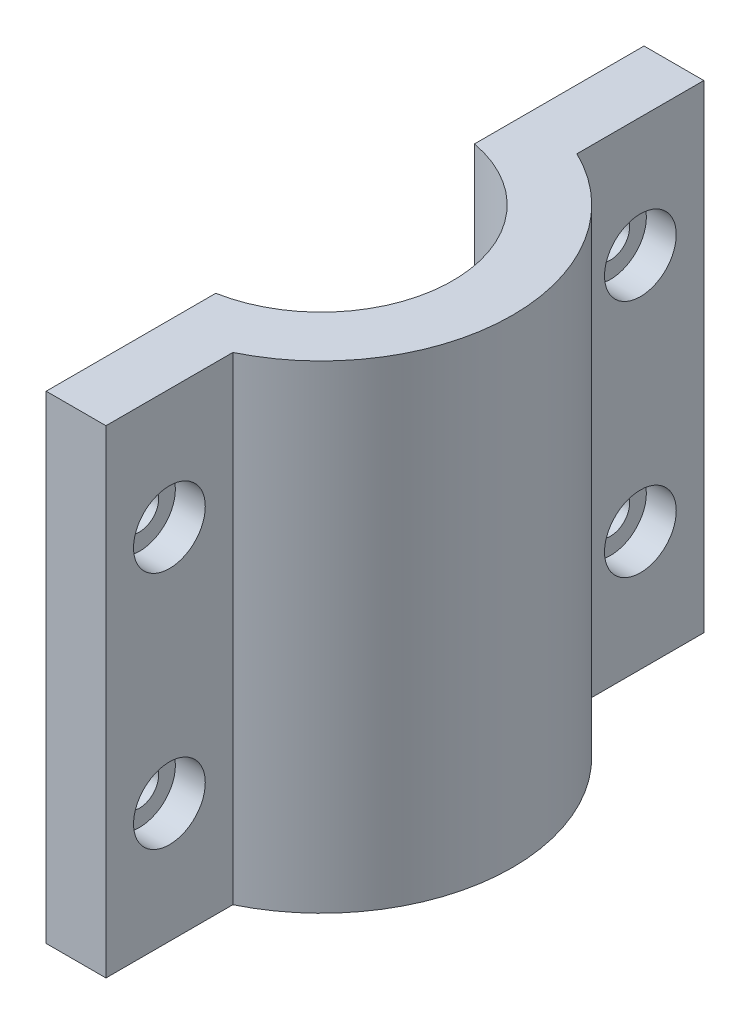
ISO-10303-21;
HEADER;
FILE_DESCRIPTION(('STEP AP214'),'2;1');
FILE_NAME('part.step','',(''),(''),'','','');
FILE_SCHEMA(('AUTOMOTIVE_DESIGN { 1 0 10303 214 1 1 1 1 }'));
ENDSEC;
DATA;
#1=APPLICATION_CONTEXT('core data for automotive mechanical design processes');
#2=APPLICATION_PROTOCOL_DEFINITION('international standard','automotive_design',2000,#1);
#3=PRODUCT_CONTEXT('',#1,'mechanical');
#4=PRODUCT('Part','Part','',(#3));
#5=PRODUCT_RELATED_PRODUCT_CATEGORY('part','',(#4));
#6=PRODUCT_DEFINITION_FORMATION('','',#4);
#7=PRODUCT_DEFINITION_CONTEXT('part definition',#1,'design');
#8=PRODUCT_DEFINITION('design','',#6,#7);
#9=PRODUCT_DEFINITION_SHAPE('','',#8);
#10=(LENGTH_UNIT() NAMED_UNIT(*) SI_UNIT(.MILLI.,.METRE.));
#11=(NAMED_UNIT(*) PLANE_ANGLE_UNIT() SI_UNIT($,.RADIAN.));
#12=(NAMED_UNIT(*) SI_UNIT($,.STERADIAN.) SOLID_ANGLE_UNIT());
#13=UNCERTAINTY_MEASURE_WITH_UNIT(LENGTH_MEASURE(1.E-05),#10,'distance_accuracy_value','');
#14=(GEOMETRIC_REPRESENTATION_CONTEXT(3) GLOBAL_UNCERTAINTY_ASSIGNED_CONTEXT((#13)) GLOBAL_UNIT_ASSIGNED_CONTEXT((#10,
#11,#12)) REPRESENTATION_CONTEXT('',''));
#15=CARTESIAN_POINT('',(0.,0.,0.));
#16=DIRECTION('',(0.,0.,1.));
#17=DIRECTION('',(1.,0.,0.));
#18=AXIS2_PLACEMENT_3D('',#15,#16,#17);
#19=CARTESIAN_POINT('',(0.,12.7,25.0110590519107));
#20=DIRECTION('',(1.,0.,0.));
#21=DIRECTION('',(0.,0.,-1.));
#22=AXIS2_PLACEMENT_3D('',#19,#20,#21);
#23=CYLINDRICAL_SURFACE('',#22,2.032);
#24=CARTESIAN_POINT('',(0.,12.7,25.0110590519107));
#25=DIRECTION('',(1.,0.,0.));
#26=DIRECTION('',(0.,0.,-1.));
#27=AXIS2_PLACEMENT_3D('',#24,#25,#26);
#28=CIRCLE('',#27,2.032);
#29=CARTESIAN_POINT('',(0.,12.7,22.9790590519107));
#30=VERTEX_POINT('',#29);
#31=EDGE_CURVE('E197',#30,#30,#28,.T.);
#32=ORIENTED_EDGE('',*,*,#31,.F.);
#33=EDGE_LOOP('',(#32));
#34=FACE_BOUND('',#33,.T.);
#35=CARTESIAN_POINT('',(3.175,12.7,25.0110590519107));
#36=DIRECTION('',(1.,0.,0.));
#37=DIRECTION('',(0.,0.,-1.));
#38=AXIS2_PLACEMENT_3D('',#35,#36,#37);
#39=CIRCLE('',#38,2.032);
#40=CARTESIAN_POINT('',(3.175,12.7,22.9790590519107));
#41=VERTEX_POINT('',#40);
#42=EDGE_CURVE('E45',#41,#41,#39,.F.);
#43=ORIENTED_EDGE('',*,*,#42,.F.);
#44=EDGE_LOOP('',(#43));
#45=FACE_BOUND('',#44,.T.);
#46=ADVANCED_FACE('F41',(#34,#45),#23,.F.);
#47=CARTESIAN_POINT('',(0.,38.1,25.0110590519107));
#48=DIRECTION('',(1.,0.,0.));
#49=DIRECTION('',(0.,0.,-1.));
#50=AXIS2_PLACEMENT_3D('',#47,#48,#49);
#51=CYLINDRICAL_SURFACE('',#50,2.032);
#52=CARTESIAN_POINT('',(0.,38.1,25.0110590519107));
#53=DIRECTION('',(1.,0.,0.));
#54=DIRECTION('',(0.,0.,1.));
#55=AXIS2_PLACEMENT_3D('',#52,#53,#54);
#56=CIRCLE('',#55,2.032);
#57=CARTESIAN_POINT('',(0.,38.1,27.0430590519107));
#58=VERTEX_POINT('',#57);
#59=EDGE_CURVE('E192',#58,#58,#56,.T.);
#60=ORIENTED_EDGE('',*,*,#59,.F.);
#61=EDGE_LOOP('',(#60));
#62=FACE_BOUND('',#61,.T.);
#63=CARTESIAN_POINT('',(3.175,38.1,25.0110590519107));
#64=DIRECTION('',(1.,0.,0.));
#65=DIRECTION('',(0.,0.,-1.));
#66=AXIS2_PLACEMENT_3D('',#63,#64,#65);
#67=CIRCLE('',#66,2.032);
#68=CARTESIAN_POINT('',(3.175,38.1,22.9790590519107));
#69=VERTEX_POINT('',#68);
#70=EDGE_CURVE('E185',#69,#69,#67,.F.);
#71=ORIENTED_EDGE('',*,*,#70,.F.);
#72=EDGE_LOOP('',(#71));
#73=FACE_BOUND('',#72,.T.);
#74=ADVANCED_FACE('F249',(#62,#73),#51,.F.);
#75=CARTESIAN_POINT('',(0.,38.1,-25.0110590519107));
#76=DIRECTION('',(1.,0.,0.));
#77=DIRECTION('',(0.,0.,-1.));
#78=AXIS2_PLACEMENT_3D('',#75,#76,#77);
#79=CYLINDRICAL_SURFACE('',#78,2.032);
#80=CARTESIAN_POINT('',(0.,38.1,-25.0110590519107));
#81=DIRECTION('',(1.,0.,0.));
#82=DIRECTION('',(0.,0.,-1.));
#83=AXIS2_PLACEMENT_3D('',#80,#81,#82);
#84=CIRCLE('',#83,2.032);
#85=CARTESIAN_POINT('',(0.,38.1,-27.0430590519107));
#86=VERTEX_POINT('',#85);
#87=EDGE_CURVE('E157',#86,#86,#84,.T.);
#88=ORIENTED_EDGE('',*,*,#87,.F.);
#89=EDGE_LOOP('',(#88));
#90=FACE_BOUND('',#89,.T.);
#91=CARTESIAN_POINT('',(3.175,38.1,-25.0110590519107));
#92=DIRECTION('',(1.,0.,0.));
#93=DIRECTION('',(0.,0.,-1.));
#94=AXIS2_PLACEMENT_3D('',#91,#92,#93);
#95=CIRCLE('',#94,2.032);
#96=CARTESIAN_POINT('',(3.175,38.1,-27.0430590519107));
#97=VERTEX_POINT('',#96);
#98=EDGE_CURVE('E181',#97,#97,#95,.F.);
#99=ORIENTED_EDGE('',*,*,#98,.F.);
#100=EDGE_LOOP('',(#99));
#101=FACE_BOUND('',#100,.T.);
#102=ADVANCED_FACE('F255',(#90,#101),#79,.F.);
#103=CARTESIAN_POINT('',(0.,12.7,-25.0110590519107));
#104=DIRECTION('',(1.,0.,0.));
#105=DIRECTION('',(0.,0.,-1.));
#106=AXIS2_PLACEMENT_3D('',#103,#104,#105);
#107=CYLINDRICAL_SURFACE('',#106,2.032);
#108=CARTESIAN_POINT('',(0.,12.7,-25.0110590519107));
#109=DIRECTION('',(1.,0.,0.));
#110=DIRECTION('',(0.,0.,1.));
#111=AXIS2_PLACEMENT_3D('',#108,#109,#110);
#112=CIRCLE('',#111,2.032);
#113=CARTESIAN_POINT('',(0.,12.7,-22.9790590519107));
#114=VERTEX_POINT('',#113);
#115=EDGE_CURVE('E203',#114,#114,#112,.T.);
#116=ORIENTED_EDGE('',*,*,#115,.F.);
#117=EDGE_LOOP('',(#116));
#118=FACE_BOUND('',#117,.T.);
#119=CARTESIAN_POINT('',(3.175,12.7,-25.0110590519107));
#120=DIRECTION('',(1.,0.,0.));
#121=DIRECTION('',(0.,0.,-1.));
#122=AXIS2_PLACEMENT_3D('',#119,#120,#121);
#123=CIRCLE('',#122,2.032);
#124=CARTESIAN_POINT('',(3.175,12.7,-27.0430590519107));
#125=VERTEX_POINT('',#124);
#126=EDGE_CURVE('E177',#125,#125,#123,.F.);
#127=ORIENTED_EDGE('',*,*,#126,.F.);
#128=EDGE_LOOP('',(#127));
#129=FACE_BOUND('',#128,.T.);
#130=ADVANCED_FACE('F261',(#118,#129),#107,.F.);
#131=CARTESIAN_POINT('',(-2.54,116.742235327596,0.));
#132=DIRECTION('',(0.,-1.,0.));
#133=DIRECTION('',(0.,0.,-1.));
#134=AXIS2_PLACEMENT_3D('',#131,#132,#133);
#135=CYLINDRICAL_SURFACE('',#134,20.32);
#136=DIRECTION('',(0.,-1.,0.));
#137=VECTOR('',#136,1.);
#138=CARTESIAN_POINT('',(6.35,116.742235327596,-18.2721181038215));
#139=LINE('',#138,#137);
#140=CARTESIAN_POINT('',(6.35,50.8,-18.2721181038215));
#141=VERTEX_POINT('',#140);
#142=CARTESIAN_POINT('',(6.35,0.,-18.2721181038215));
#143=VERTEX_POINT('',#142);
#144=EDGE_CURVE('E98',#141,#143,#139,.T.);
#145=ORIENTED_EDGE('',*,*,#144,.F.);
#146=CARTESIAN_POINT('',(-2.54,50.8,0.));
#147=DIRECTION('',(0.,1.,0.));
#148=DIRECTION('',(0.,0.,1.));
#149=AXIS2_PLACEMENT_3D('',#146,#147,#148);
#150=CIRCLE('',#149,20.32);
#151=CARTESIAN_POINT('',(6.35,50.8,18.2721181038215));
#152=VERTEX_POINT('',#151);
#153=EDGE_CURVE('E155',#141,#152,#150,.F.);
#154=ORIENTED_EDGE('',*,*,#153,.T.);
#155=DIRECTION('',(0.,-1.,0.));
#156=VECTOR('',#155,1.);
#157=CARTESIAN_POINT('',(6.35,116.742235327596,18.2721181038215));
#158=LINE('',#157,#156);
#159=CARTESIAN_POINT('',(6.35,0.,18.2721181038215));
#160=VERTEX_POINT('',#159);
#161=EDGE_CURVE('E59',#152,#160,#158,.T.);
#162=ORIENTED_EDGE('',*,*,#161,.T.);
#163=CARTESIAN_POINT('',(-2.54,0.,0.));
#164=DIRECTION('',(0.,1.,0.));
#165=DIRECTION('',(0.,0.,1.));
#166=AXIS2_PLACEMENT_3D('',#163,#164,#165);
#167=CIRCLE('',#166,20.32);
#168=EDGE_CURVE('E212',#143,#160,#167,.F.);
#169=ORIENTED_EDGE('',*,*,#168,.F.);
#170=EDGE_LOOP('',(#145,#154,#162,#169));
#171=FACE_BOUND('',#170,.T.);
#172=ADVANCED_FACE('F235',(#171),#135,.T.);
#173=CARTESIAN_POINT('',(6.35000000000002,116.742235327596,0.));
#174=DIRECTION('',(-1.,0.,0.));
#175=DIRECTION('',(0.,0.,1.));
#176=AXIS2_PLACEMENT_3D('',#173,#174,#175);
#177=PLANE('',#176);
#178=CARTESIAN_POINT('',(6.35,12.7,-25.0110590519107));
#179=DIRECTION('',(1.,0.,0.));
#180=DIRECTION('',(0.,0.,1.));
#181=AXIS2_PLACEMENT_3D('',#178,#179,#180);
#182=CIRCLE('',#181,3.81);
#183=CARTESIAN_POINT('',(6.35,12.7,-21.2010590519107));
#184=VERTEX_POINT('',#183);
#185=EDGE_CURVE('E325',#184,#184,#182,.T.);
#186=ORIENTED_EDGE('',*,*,#185,.F.);
#187=EDGE_LOOP('',(#186));
#188=FACE_BOUND('',#187,.T.);
#189=CARTESIAN_POINT('',(6.35,38.1,-25.0110590519107));
#190=DIRECTION('',(1.,0.,0.));
#191=DIRECTION('',(0.,0.,-1.));
#192=AXIS2_PLACEMENT_3D('',#189,#190,#191);
#193=CIRCLE('',#192,3.81);
#194=CARTESIAN_POINT('',(6.35,38.1,-28.8210590519107));
#195=VERTEX_POINT('',#194);
#196=EDGE_CURVE('E332',#195,#195,#193,.T.);
#197=ORIENTED_EDGE('',*,*,#196,.F.);
#198=EDGE_LOOP('',(#197));
#199=FACE_BOUND('',#198,.T.);
#200=DIRECTION('',(0.,0.,-1.));
#201=VECTOR('',#200,1.);
#202=CARTESIAN_POINT('',(6.35000000000002,50.8,0.));
#203=LINE('',#202,#201);
#204=CARTESIAN_POINT('',(6.35,50.8,-31.75));
#205=VERTEX_POINT('',#204);
#206=EDGE_CURVE('E105',#141,#205,#203,.T.);
#207=ORIENTED_EDGE('',*,*,#206,.F.);
#208=ORIENTED_EDGE('',*,*,#144,.T.);
#209=DIRECTION('',(0.,0.,-1.));
#210=VECTOR('',#209,1.);
#211=CARTESIAN_POINT('',(6.35000000000002,0.,0.));
#212=LINE('',#211,#210);
#213=CARTESIAN_POINT('',(6.35,0.,-31.75));
#214=VERTEX_POINT('',#213);
#215=EDGE_CURVE('E151',#143,#214,#212,.T.);
#216=ORIENTED_EDGE('',*,*,#215,.T.);
#217=DIRECTION('',(0.,-1.,0.));
#218=VECTOR('',#217,1.);
#219=CARTESIAN_POINT('',(6.35,116.742235327596,-31.75));
#220=LINE('',#219,#218);
#221=EDGE_CURVE('E147',#205,#214,#220,.T.);
#222=ORIENTED_EDGE('',*,*,#221,.F.);
#223=EDGE_LOOP('',(#207,#208,#216,#222));
#224=FACE_BOUND('',#223,.T.);
#225=ADVANCED_FACE('F364',(#188,#199,#224),#177,.F.);
#226=CARTESIAN_POINT('',(0.,116.742235327596,-31.75));
#227=DIRECTION('',(0.,0.,-1.));
#228=DIRECTION('',(-1.,0.,0.));
#229=AXIS2_PLACEMENT_3D('',#226,#227,#228);
#230=PLANE('',#229);
#231=DIRECTION('',(0.,-1.,0.));
#232=VECTOR('',#231,1.);
#233=CARTESIAN_POINT('',(0.,116.742235327596,-31.75));
#234=LINE('',#233,#232);
#235=CARTESIAN_POINT('',(0.,50.8,-31.75));
#236=VERTEX_POINT('',#235);
#237=CARTESIAN_POINT('',(0.,0.,-31.75));
#238=VERTEX_POINT('',#237);
#239=EDGE_CURVE('E146',#236,#238,#234,.T.);
#240=ORIENTED_EDGE('',*,*,#239,.F.);
#241=DIRECTION('',(1.,0.,0.));
#242=VECTOR('',#241,1.);
#243=CARTESIAN_POINT('',(0.,50.8,-31.75));
#244=LINE('',#243,#242);
#245=EDGE_CURVE('E148',#236,#205,#244,.T.);
#246=ORIENTED_EDGE('',*,*,#245,.T.);
#247=ORIENTED_EDGE('',*,*,#221,.T.);
#248=DIRECTION('',(1.,0.,0.));
#249=VECTOR('',#248,1.);
#250=CARTESIAN_POINT('',(0.,0.,-31.75));
#251=LINE('',#250,#249);
#252=EDGE_CURVE('E154',#238,#214,#251,.T.);
#253=ORIENTED_EDGE('',*,*,#252,.F.);
#254=EDGE_LOOP('',(#240,#246,#247,#253));
#255=FACE_BOUND('',#254,.T.);
#256=ADVANCED_FACE('F353',(#255),#230,.T.);
#257=CARTESIAN_POINT('',(0.,116.742235327596,0.));
#258=DIRECTION('',(-1.,0.,0.));
#259=DIRECTION('',(0.,0.,1.));
#260=AXIS2_PLACEMENT_3D('',#257,#258,#259);
#261=PLANE('',#260);
#262=ORIENTED_EDGE('',*,*,#115,.T.);
#263=EDGE_LOOP('',(#262));
#264=FACE_BOUND('',#263,.T.);
#265=ORIENTED_EDGE('',*,*,#87,.T.);
#266=EDGE_LOOP('',(#265));
#267=FACE_BOUND('',#266,.T.);
#268=DIRECTION('',(0.,-1.,0.));
#269=VECTOR('',#268,1.);
#270=CARTESIAN_POINT('',(0.,116.742235327596,-13.7371503595178));
#271=LINE('',#270,#269);
#272=CARTESIAN_POINT('',(0.,50.8,-13.7371503595178));
#273=VERTEX_POINT('',#272);
#274=CARTESIAN_POINT('',(0.,0.,-13.7371503595178));
#275=VERTEX_POINT('',#274);
#276=EDGE_CURVE('E165',#273,#275,#271,.T.);
#277=ORIENTED_EDGE('',*,*,#276,.F.);
#278=DIRECTION('',(0.,0.,-1.));
#279=VECTOR('',#278,1.);
#280=CARTESIAN_POINT('',(0.,50.8,0.));
#281=LINE('',#280,#279);
#282=EDGE_CURVE('E143',#273,#236,#281,.T.);
#283=ORIENTED_EDGE('',*,*,#282,.T.);
#284=ORIENTED_EDGE('',*,*,#239,.T.);
#285=DIRECTION('',(0.,0.,-1.));
#286=VECTOR('',#285,1.);
#287=CARTESIAN_POINT('',(0.,0.,0.));
#288=LINE('',#287,#286);
#289=EDGE_CURVE('E220',#275,#238,#288,.T.);
#290=ORIENTED_EDGE('',*,*,#289,.F.);
#291=EDGE_LOOP('',(#277,#283,#284,#290));
#292=FACE_BOUND('',#291,.T.);
#293=ADVANCED_FACE('F346',(#264,#267,#292),#261,.T.);
#294=CARTESIAN_POINT('',(-2.54,116.742235327596,0.));
#295=DIRECTION('',(0.,-1.,0.));
#296=DIRECTION('',(0.,0.,-1.));
#297=AXIS2_PLACEMENT_3D('',#294,#295,#296);
#298=CYLINDRICAL_SURFACE('',#297,13.97);
#299=CARTESIAN_POINT('',(-2.54,50.8,0.));
#300=DIRECTION('',(0.,1.,0.));
#301=DIRECTION('',(0.,0.,1.));
#302=AXIS2_PLACEMENT_3D('',#299,#300,#301);
#303=CIRCLE('',#302,13.97);
#304=CARTESIAN_POINT('',(0.,50.8,13.7371503595178));
#305=VERTEX_POINT('',#304);
#306=EDGE_CURVE('E136',#273,#305,#303,.F.);
#307=ORIENTED_EDGE('',*,*,#306,.F.);
#308=ORIENTED_EDGE('',*,*,#276,.T.);
#309=CARTESIAN_POINT('',(-2.54,0.,0.));
#310=DIRECTION('',(0.,1.,0.));
#311=DIRECTION('',(0.,0.,1.));
#312=AXIS2_PLACEMENT_3D('',#309,#310,#311);
#313=CIRCLE('',#312,13.97);
#314=CARTESIAN_POINT('',(0.,0.,13.7371503595178));
#315=VERTEX_POINT('',#314);
#316=EDGE_CURVE('E168',#275,#315,#313,.F.);
#317=ORIENTED_EDGE('',*,*,#316,.T.);
#318=DIRECTION('',(0.,-1.,0.));
#319=VECTOR('',#318,1.);
#320=CARTESIAN_POINT('',(0.,116.742235327596,13.7371503595178));
#321=LINE('',#320,#319);
#322=EDGE_CURVE('E169',#305,#315,#321,.T.);
#323=ORIENTED_EDGE('',*,*,#322,.F.);
#324=EDGE_LOOP('',(#307,#308,#317,#323));
#325=FACE_BOUND('',#324,.T.);
#326=ADVANCED_FACE('F352',(#325),#298,.F.);
#327=CARTESIAN_POINT('',(0.,116.742235327596,0.));
#328=DIRECTION('',(1.,0.,0.));
#329=DIRECTION('',(0.,0.,-1.));
#330=AXIS2_PLACEMENT_3D('',#327,#328,#329);
#331=PLANE('',#330);
#332=ORIENTED_EDGE('',*,*,#59,.T.);
#333=EDGE_LOOP('',(#332));
#334=FACE_BOUND('',#333,.T.);
#335=ORIENTED_EDGE('',*,*,#31,.T.);
#336=EDGE_LOOP('',(#335));
#337=FACE_BOUND('',#336,.T.);
#338=DIRECTION('',(0.,0.,1.));
#339=VECTOR('',#338,1.);
#340=CARTESIAN_POINT('',(0.,50.8,0.));
#341=LINE('',#340,#339);
#342=CARTESIAN_POINT('',(0.,50.8,31.75));
#343=VERTEX_POINT('',#342);
#344=EDGE_CURVE('E122',#305,#343,#341,.T.);
#345=ORIENTED_EDGE('',*,*,#344,.F.);
#346=ORIENTED_EDGE('',*,*,#322,.T.);
#347=DIRECTION('',(0.,0.,1.));
#348=VECTOR('',#347,1.);
#349=CARTESIAN_POINT('',(0.,0.,0.));
#350=LINE('',#349,#348);
#351=CARTESIAN_POINT('',(0.,0.,31.75));
#352=VERTEX_POINT('',#351);
#353=EDGE_CURVE('E128',#315,#352,#350,.T.);
#354=ORIENTED_EDGE('',*,*,#353,.T.);
#355=DIRECTION('',(0.,-1.,0.));
#356=VECTOR('',#355,1.);
#357=CARTESIAN_POINT('',(0.,116.742235327596,31.75));
#358=LINE('',#357,#356);
#359=EDGE_CURVE('E117',#343,#352,#358,.T.);
#360=ORIENTED_EDGE('',*,*,#359,.F.);
#361=EDGE_LOOP('',(#345,#346,#354,#360));
#362=FACE_BOUND('',#361,.T.);
#363=ADVANCED_FACE('F125',(#334,#337,#362),#331,.F.);
#364=CARTESIAN_POINT('',(0.,116.742235327596,31.75));
#365=DIRECTION('',(0.,0.,-1.));
#366=DIRECTION('',(-1.,0.,0.));
#367=AXIS2_PLACEMENT_3D('',#364,#365,#366);
#368=PLANE('',#367);
#369=DIRECTION('',(1.,0.,0.));
#370=VECTOR('',#369,1.);
#371=CARTESIAN_POINT('',(0.,50.8,31.75));
#372=LINE('',#371,#370);
#373=CARTESIAN_POINT('',(6.35,50.8,31.75));
#374=VERTEX_POINT('',#373);
#375=EDGE_CURVE('E51',#343,#374,#372,.T.);
#376=ORIENTED_EDGE('',*,*,#375,.F.);
#377=ORIENTED_EDGE('',*,*,#359,.T.);
#378=DIRECTION('',(1.,0.,0.));
#379=VECTOR('',#378,1.);
#380=CARTESIAN_POINT('',(0.,0.,31.75));
#381=LINE('',#380,#379);
#382=CARTESIAN_POINT('',(6.35,0.,31.75));
#383=VERTEX_POINT('',#382);
#384=EDGE_CURVE('E131',#352,#383,#381,.T.);
#385=ORIENTED_EDGE('',*,*,#384,.T.);
#386=DIRECTION('',(0.,-1.,0.));
#387=VECTOR('',#386,1.);
#388=CARTESIAN_POINT('',(6.35,116.742235327596,31.75));
#389=LINE('',#388,#387);
#390=EDGE_CURVE('E65',#374,#383,#389,.T.);
#391=ORIENTED_EDGE('',*,*,#390,.F.);
#392=EDGE_LOOP('',(#376,#377,#385,#391));
#393=FACE_BOUND('',#392,.T.);
#394=ADVANCED_FACE('F116',(#393),#368,.F.);
#395=CARTESIAN_POINT('',(6.35,116.742235327596,0.));
#396=DIRECTION('',(-1.,0.,0.));
#397=DIRECTION('',(0.,0.,1.));
#398=AXIS2_PLACEMENT_3D('',#395,#396,#397);
#399=PLANE('',#398);
#400=CARTESIAN_POINT('',(6.35000000000004,38.1,25.0110590519107));
#401=DIRECTION('',(1.,0.,0.));
#402=DIRECTION('',(0.,0.,1.));
#403=AXIS2_PLACEMENT_3D('',#400,#401,#402);
#404=CIRCLE('',#403,3.81);
#405=CARTESIAN_POINT('',(6.35000000000005,38.1,28.8210590519107));
#406=VERTEX_POINT('',#405);
#407=EDGE_CURVE('E314',#406,#406,#404,.T.);
#408=ORIENTED_EDGE('',*,*,#407,.F.);
#409=EDGE_LOOP('',(#408));
#410=FACE_BOUND('',#409,.T.);
#411=CARTESIAN_POINT('',(6.35000000000004,12.7,25.0110590519107));
#412=DIRECTION('',(1.,0.,0.));
#413=DIRECTION('',(0.,0.,-1.));
#414=AXIS2_PLACEMENT_3D('',#411,#412,#413);
#415=CIRCLE('',#414,3.81);
#416=CARTESIAN_POINT('',(6.35000000000004,12.7,21.2010590519107));
#417=VERTEX_POINT('',#416);
#418=EDGE_CURVE('E315',#417,#417,#415,.T.);
#419=ORIENTED_EDGE('',*,*,#418,.F.);
#420=EDGE_LOOP('',(#419));
#421=FACE_BOUND('',#420,.T.);
#422=DIRECTION('',(0.,0.,-1.));
#423=VECTOR('',#422,1.);
#424=CARTESIAN_POINT('',(6.35,50.8,0.));
#425=LINE('',#424,#423);
#426=EDGE_CURVE('E11',#374,#152,#425,.T.);
#427=ORIENTED_EDGE('',*,*,#426,.F.);
#428=ORIENTED_EDGE('',*,*,#390,.T.);
#429=DIRECTION('',(0.,0.,-1.));
#430=VECTOR('',#429,1.);
#431=CARTESIAN_POINT('',(6.35,0.,0.));
#432=LINE('',#431,#430);
#433=EDGE_CURVE('E174',#383,#160,#432,.T.);
#434=ORIENTED_EDGE('',*,*,#433,.T.);
#435=ORIENTED_EDGE('',*,*,#161,.F.);
#436=EDGE_LOOP('',(#427,#428,#434,#435));
#437=FACE_BOUND('',#436,.T.);
#438=ADVANCED_FACE('F236',(#410,#421,#437),#399,.F.);
#439=CARTESIAN_POINT('',(0.,0.,0.));
#440=DIRECTION('',(0.,1.,0.));
#441=DIRECTION('',(0.,0.,1.));
#442=AXIS2_PLACEMENT_3D('',#439,#440,#441);
#443=PLANE('',#442);
#444=ORIENTED_EDGE('',*,*,#168,.T.);
#445=ORIENTED_EDGE('',*,*,#433,.F.);
#446=ORIENTED_EDGE('',*,*,#384,.F.);
#447=ORIENTED_EDGE('',*,*,#353,.F.);
#448=ORIENTED_EDGE('',*,*,#316,.F.);
#449=ORIENTED_EDGE('',*,*,#289,.T.);
#450=ORIENTED_EDGE('',*,*,#252,.T.);
#451=ORIENTED_EDGE('',*,*,#215,.F.);
#452=EDGE_LOOP('',(#444,#445,#446,#447,#448,#449,#450,#451));
#453=FACE_BOUND('',#452,.T.);
#454=ADVANCED_FACE('F233',(#453),#443,.F.);
#455=CARTESIAN_POINT('',(0.,50.8,0.));
#456=DIRECTION('',(0.,1.,0.));
#457=DIRECTION('',(0.,0.,1.));
#458=AXIS2_PLACEMENT_3D('',#455,#456,#457);
#459=PLANE('',#458);
#460=ORIENTED_EDGE('',*,*,#153,.F.);
#461=ORIENTED_EDGE('',*,*,#206,.T.);
#462=ORIENTED_EDGE('',*,*,#245,.F.);
#463=ORIENTED_EDGE('',*,*,#282,.F.);
#464=ORIENTED_EDGE('',*,*,#306,.T.);
#465=ORIENTED_EDGE('',*,*,#344,.T.);
#466=ORIENTED_EDGE('',*,*,#375,.T.);
#467=ORIENTED_EDGE('',*,*,#426,.T.);
#468=EDGE_LOOP('',(#460,#461,#462,#463,#464,#465,#466,#467));
#469=FACE_BOUND('',#468,.T.);
#470=ADVANCED_FACE('F43',(#469),#459,.T.);
#471=CARTESIAN_POINT('',(3.175,0.,0.));
#472=DIRECTION('',(1.,0.,0.));
#473=DIRECTION('',(0.,0.,-1.));
#474=AXIS2_PLACEMENT_3D('',#471,#472,#473);
#475=PLANE('',#474);
#476=CARTESIAN_POINT('',(3.175,12.7,-25.0110590519107));
#477=DIRECTION('',(1.,0.,0.));
#478=DIRECTION('',(0.,0.,-1.));
#479=AXIS2_PLACEMENT_3D('',#476,#477,#478);
#480=CIRCLE('',#479,3.81);
#481=CARTESIAN_POINT('',(3.175,12.7,-28.8210590519107));
#482=VERTEX_POINT('',#481);
#483=EDGE_CURVE('E329',#482,#482,#480,.F.);
#484=ORIENTED_EDGE('',*,*,#483,.F.);
#485=EDGE_LOOP('',(#484));
#486=FACE_BOUND('',#485,.T.);
#487=ORIENTED_EDGE('',*,*,#126,.T.);
#488=EDGE_LOOP('',(#487));
#489=FACE_BOUND('',#488,.T.);
#490=ADVANCED_FACE('F286',(#486,#489),#475,.T.);
#491=CARTESIAN_POINT('',(-7.60130734528303,12.7,-25.0110590519107));
#492=DIRECTION('',(1.,0.,0.));
#493=DIRECTION('',(0.,0.,-1.));
#494=AXIS2_PLACEMENT_3D('',#491,#492,#493);
#495=CYLINDRICAL_SURFACE('',#494,3.81);
#496=ORIENTED_EDGE('',*,*,#483,.T.);
#497=EDGE_LOOP('',(#496));
#498=FACE_BOUND('',#497,.T.);
#499=ORIENTED_EDGE('',*,*,#185,.T.);
#500=EDGE_LOOP('',(#499));
#501=FACE_BOUND('',#500,.T.);
#502=ADVANCED_FACE('F277',(#498,#501),#495,.F.);
#503=CARTESIAN_POINT('',(3.175,0.,0.));
#504=DIRECTION('',(1.,0.,0.));
#505=DIRECTION('',(0.,0.,-1.));
#506=AXIS2_PLACEMENT_3D('',#503,#504,#505);
#507=PLANE('',#506);
#508=CARTESIAN_POINT('',(3.175,38.1,-25.0110590519107));
#509=DIRECTION('',(1.,0.,0.));
#510=DIRECTION('',(0.,0.,-1.));
#511=AXIS2_PLACEMENT_3D('',#508,#509,#510);
#512=CIRCLE('',#511,3.81);
#513=CARTESIAN_POINT('',(3.175,38.1,-28.8210590519107));
#514=VERTEX_POINT('',#513);
#515=EDGE_CURVE('E182',#514,#514,#512,.F.);
#516=ORIENTED_EDGE('',*,*,#515,.F.);
#517=EDGE_LOOP('',(#516));
#518=FACE_BOUND('',#517,.T.);
#519=ORIENTED_EDGE('',*,*,#98,.T.);
#520=EDGE_LOOP('',(#519));
#521=FACE_BOUND('',#520,.T.);
#522=ADVANCED_FACE('F274',(#518,#521),#507,.T.);
#523=CARTESIAN_POINT('',(-7.60130734528303,38.1,-25.0110590519107));
#524=DIRECTION('',(1.,0.,0.));
#525=DIRECTION('',(0.,0.,-1.));
#526=AXIS2_PLACEMENT_3D('',#523,#524,#525);
#527=CYLINDRICAL_SURFACE('',#526,3.81);
#528=ORIENTED_EDGE('',*,*,#515,.T.);
#529=EDGE_LOOP('',(#528));
#530=FACE_BOUND('',#529,.T.);
#531=ORIENTED_EDGE('',*,*,#196,.T.);
#532=EDGE_LOOP('',(#531));
#533=FACE_BOUND('',#532,.T.);
#534=ADVANCED_FACE('F276',(#530,#533),#527,.F.);
#535=CARTESIAN_POINT('',(3.175,0.,0.));
#536=DIRECTION('',(1.,0.,0.));
#537=DIRECTION('',(0.,0.,-1.));
#538=AXIS2_PLACEMENT_3D('',#535,#536,#537);
#539=PLANE('',#538);
#540=CARTESIAN_POINT('',(3.175,38.1,25.0110590519107));
#541=DIRECTION('',(1.,0.,0.));
#542=DIRECTION('',(0.,0.,-1.));
#543=AXIS2_PLACEMENT_3D('',#540,#541,#542);
#544=CIRCLE('',#543,3.81);
#545=CARTESIAN_POINT('',(3.175,38.1,21.2010590519107));
#546=VERTEX_POINT('',#545);
#547=EDGE_CURVE('E320',#546,#546,#544,.F.);
#548=ORIENTED_EDGE('',*,*,#547,.F.);
#549=EDGE_LOOP('',(#548));
#550=FACE_BOUND('',#549,.T.);
#551=ORIENTED_EDGE('',*,*,#70,.T.);
#552=EDGE_LOOP('',(#551));
#553=FACE_BOUND('',#552,.T.);
#554=ADVANCED_FACE('F284',(#550,#553),#539,.T.);
#555=CARTESIAN_POINT('',(-7.60130734528299,38.1,25.0110590519107));
#556=DIRECTION('',(1.,0.,0.));
#557=DIRECTION('',(0.,0.,-1.));
#558=AXIS2_PLACEMENT_3D('',#555,#556,#557);
#559=CYLINDRICAL_SURFACE('',#558,3.81);
#560=ORIENTED_EDGE('',*,*,#547,.T.);
#561=EDGE_LOOP('',(#560));
#562=FACE_BOUND('',#561,.T.);
#563=ORIENTED_EDGE('',*,*,#407,.T.);
#564=EDGE_LOOP('',(#563));
#565=FACE_BOUND('',#564,.T.);
#566=ADVANCED_FACE('F291',(#562,#565),#559,.F.);
#567=CARTESIAN_POINT('',(3.175,0.,0.));
#568=DIRECTION('',(1.,0.,0.));
#569=DIRECTION('',(0.,0.,-1.));
#570=AXIS2_PLACEMENT_3D('',#567,#568,#569);
#571=PLANE('',#570);
#572=CARTESIAN_POINT('',(3.175,12.7,25.0110590519107));
#573=DIRECTION('',(1.,0.,0.));
#574=DIRECTION('',(0.,0.,-1.));
#575=AXIS2_PLACEMENT_3D('',#572,#573,#574);
#576=CIRCLE('',#575,3.81);
#577=CARTESIAN_POINT('',(3.175,12.7,21.2010590519107));
#578=VERTEX_POINT('',#577);
#579=EDGE_CURVE('E312',#578,#578,#576,.F.);
#580=ORIENTED_EDGE('',*,*,#579,.F.);
#581=EDGE_LOOP('',(#580));
#582=FACE_BOUND('',#581,.T.);
#583=ORIENTED_EDGE('',*,*,#42,.T.);
#584=EDGE_LOOP('',(#583));
#585=FACE_BOUND('',#584,.T.);
#586=ADVANCED_FACE('F294',(#582,#585),#571,.T.);
#587=CARTESIAN_POINT('',(-7.60130734528299,12.7,25.0110590519107));
#588=DIRECTION('',(1.,0.,0.));
#589=DIRECTION('',(0.,0.,-1.));
#590=AXIS2_PLACEMENT_3D('',#587,#588,#589);
#591=CYLINDRICAL_SURFACE('',#590,3.81);
#592=ORIENTED_EDGE('',*,*,#579,.T.);
#593=EDGE_LOOP('',(#592));
#594=FACE_BOUND('',#593,.T.);
#595=ORIENTED_EDGE('',*,*,#418,.T.);
#596=EDGE_LOOP('',(#595));
#597=FACE_BOUND('',#596,.T.);
#598=ADVANCED_FACE('F302',(#594,#597),#591,.F.);
#599=CLOSED_SHELL('',(#46,#74,#102,#130,#172,#225,#256,#293,#326,#363,#394,#438,#454,#470,#490,
#502,#522,#534,#554,#566,#586,#598));
#600=MANIFOLD_SOLID_BREP('B2',#599);
#601=ADVANCED_BREP_SHAPE_REPRESENTATION('',(#18,#600),#14);
#602=SHAPE_DEFINITION_REPRESENTATION(#9,#601);
ENDSEC;
END-ISO-10303-21;
